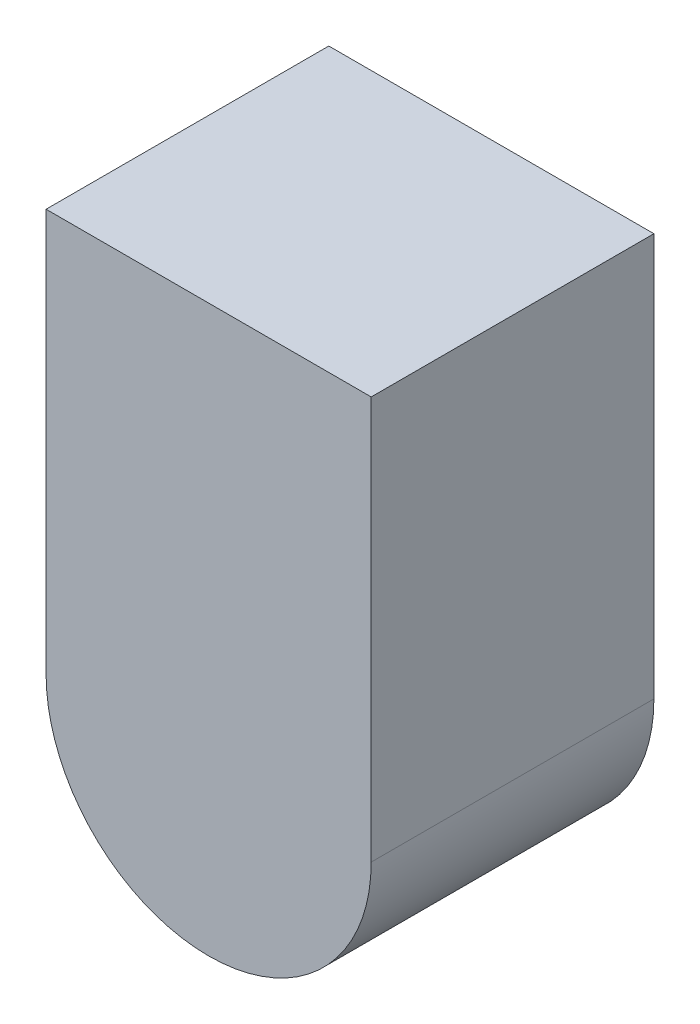
ISO-10303-21;
HEADER;
FILE_DESCRIPTION(('STEP AP214'),'2;1');
FILE_NAME('part.step','',(''),(''),'','','');
FILE_SCHEMA(('AUTOMOTIVE_DESIGN { 1 0 10303 214 1 1 1 1 }'));
ENDSEC;
DATA;
#1=APPLICATION_CONTEXT('core data for automotive mechanical design processes');
#2=APPLICATION_PROTOCOL_DEFINITION('international standard','automotive_design',2000,#1);
#3=PRODUCT_CONTEXT('',#1,'mechanical');
#4=PRODUCT('Part','Part','',(#3));
#5=PRODUCT_RELATED_PRODUCT_CATEGORY('part','',(#4));
#6=PRODUCT_DEFINITION_FORMATION('','',#4);
#7=PRODUCT_DEFINITION_CONTEXT('part definition',#1,'design');
#8=PRODUCT_DEFINITION('design','',#6,#7);
#9=PRODUCT_DEFINITION_SHAPE('','',#8);
#10=(LENGTH_UNIT() NAMED_UNIT(*) SI_UNIT(.MILLI.,.METRE.));
#11=(NAMED_UNIT(*) PLANE_ANGLE_UNIT() SI_UNIT($,.RADIAN.));
#12=(NAMED_UNIT(*) SI_UNIT($,.STERADIAN.) SOLID_ANGLE_UNIT());
#13=UNCERTAINTY_MEASURE_WITH_UNIT(LENGTH_MEASURE(1.E-05),#10,'distance_accuracy_value','');
#14=(GEOMETRIC_REPRESENTATION_CONTEXT(3) GLOBAL_UNCERTAINTY_ASSIGNED_CONTEXT((#13)) GLOBAL_UNIT_ASSIGNED_CONTEXT((#10,
#11,#12)) REPRESENTATION_CONTEXT('',''));
#15=CARTESIAN_POINT('',(0.,0.,0.));
#16=DIRECTION('',(0.,0.,1.));
#17=DIRECTION('',(1.,0.,0.));
#18=AXIS2_PLACEMENT_3D('',#15,#16,#17);
#19=CARTESIAN_POINT('',(-1.25,2.8335265642716,0.));
#20=DIRECTION('',(0.,0.,1.));
#21=DIRECTION('',(0.,-1.,0.));
#22=AXIS2_PLACEMENT_3D('',#19,#20,#21);
#23=PLANE('',#22);
#24=DIRECTION('',(-1.,0.,0.));
#25=VECTOR('',#24,1.);
#26=CARTESIAN_POINT('',(-1.135,3.,0.));
#27=LINE('',#26,#25);
#28=CARTESIAN_POINT('',(-1.135,3.,0.));
#29=VERTEX_POINT('',#28);
#30=CARTESIAN_POINT('',(-1.365,3.,0.));
#31=VERTEX_POINT('',#30);
#32=EDGE_CURVE('E11',#29,#31,#27,.T.);
#33=ORIENTED_EDGE('',*,*,#32,.F.);
#34=DIRECTION('',(0.,1.,0.));
#35=VECTOR('',#34,1.);
#36=CARTESIAN_POINT('',(-1.135,2.715,0.));
#37=LINE('',#36,#35);
#38=CARTESIAN_POINT('',(-1.135,2.715,0.));
#39=VERTEX_POINT('',#38);
#40=EDGE_CURVE('E24',#39,#29,#37,.T.);
#41=ORIENTED_EDGE('',*,*,#40,.F.);
#42=CARTESIAN_POINT('',(-1.25,2.715,0.));
#43=DIRECTION('',(0.,0.,1.));
#44=DIRECTION('',(-1.,0.,0.));
#45=AXIS2_PLACEMENT_3D('',#42,#43,#44);
#46=CIRCLE('',#45,0.115);
#47=CARTESIAN_POINT('',(-1.365,2.715,0.));
#48=VERTEX_POINT('',#47);
#49=EDGE_CURVE('E85',#48,#39,#46,.T.);
#50=ORIENTED_EDGE('',*,*,#49,.F.);
#51=DIRECTION('',(0.,-1.,0.));
#52=VECTOR('',#51,1.);
#53=CARTESIAN_POINT('',(-1.365,3.,0.));
#54=LINE('',#53,#52);
#55=EDGE_CURVE('E82',#31,#48,#54,.T.);
#56=ORIENTED_EDGE('',*,*,#55,.F.);
#57=EDGE_LOOP('',(#33,#41,#50,#56));
#58=FACE_BOUND('',#57,.T.);
#59=ADVANCED_FACE('F17',(#58),#23,.F.);
#60=CARTESIAN_POINT('',(-1.365,3.,0.));
#61=DIRECTION('',(-1.,0.,0.));
#62=DIRECTION('',(0.,-1.,0.));
#63=AXIS2_PLACEMENT_3D('',#60,#61,#62);
#64=PLANE('',#63);
#65=ORIENTED_EDGE('',*,*,#55,.T.);
#66=DIRECTION('',(0.,0.,1.));
#67=VECTOR('',#66,1.);
#68=CARTESIAN_POINT('',(-1.365,2.715,0.));
#69=LINE('',#68,#67);
#70=CARTESIAN_POINT('',(-1.365,2.715,0.2));
#71=VERTEX_POINT('',#70);
#72=EDGE_CURVE('E80',#48,#71,#69,.T.);
#73=ORIENTED_EDGE('',*,*,#72,.T.);
#74=DIRECTION('',(0.,-1.,0.));
#75=VECTOR('',#74,1.);
#76=CARTESIAN_POINT('',(-1.365,3.,0.2));
#77=LINE('',#76,#75);
#78=CARTESIAN_POINT('',(-1.365,3.,0.2));
#79=VERTEX_POINT('',#78);
#80=EDGE_CURVE('E78',#79,#71,#77,.T.);
#81=ORIENTED_EDGE('',*,*,#80,.F.);
#82=DIRECTION('',(0.,0.,-1.));
#83=VECTOR('',#82,1.);
#84=CARTESIAN_POINT('',(-1.365,3.,0.));
#85=LINE('',#84,#83);
#86=EDGE_CURVE('E71',#79,#31,#85,.T.);
#87=ORIENTED_EDGE('',*,*,#86,.T.);
#88=EDGE_LOOP('',(#65,#73,#81,#87));
#89=FACE_BOUND('',#88,.T.);
#90=ADVANCED_FACE('F91',(#89),#64,.T.);
#91=CARTESIAN_POINT('',(-1.25,2.715,0.));
#92=DIRECTION('',(0.,0.,1.));
#93=DIRECTION('',(-1.,0.,0.));
#94=AXIS2_PLACEMENT_3D('',#91,#92,#93);
#95=CYLINDRICAL_SURFACE('',#94,0.115);
#96=ORIENTED_EDGE('',*,*,#49,.T.);
#97=DIRECTION('',(0.,0.,1.));
#98=VECTOR('',#97,1.);
#99=CARTESIAN_POINT('',(-1.135,2.715,0.));
#100=LINE('',#99,#98);
#101=CARTESIAN_POINT('',(-1.135,2.715,0.2));
#102=VERTEX_POINT('',#101);
#103=EDGE_CURVE('E75',#39,#102,#100,.T.);
#104=ORIENTED_EDGE('',*,*,#103,.T.);
#105=CARTESIAN_POINT('',(-1.25,2.715,0.2));
#106=DIRECTION('',(0.,0.,1.));
#107=DIRECTION('',(-1.,0.,0.));
#108=AXIS2_PLACEMENT_3D('',#105,#106,#107);
#109=CIRCLE('',#108,0.115);
#110=EDGE_CURVE('E59',#71,#102,#109,.T.);
#111=ORIENTED_EDGE('',*,*,#110,.F.);
#112=ORIENTED_EDGE('',*,*,#72,.F.);
#113=EDGE_LOOP('',(#96,#104,#111,#112));
#114=FACE_BOUND('',#113,.T.);
#115=ADVANCED_FACE('F89',(#114),#95,.T.);
#116=CARTESIAN_POINT('',(-1.135,2.715,0.));
#117=DIRECTION('',(1.,0.,0.));
#118=DIRECTION('',(0.,1.,0.));
#119=AXIS2_PLACEMENT_3D('',#116,#117,#118);
#120=PLANE('',#119);
#121=ORIENTED_EDGE('',*,*,#40,.T.);
#122=DIRECTION('',(0.,0.,1.));
#123=VECTOR('',#122,1.);
#124=CARTESIAN_POINT('',(-1.135,3.,0.));
#125=LINE('',#124,#123);
#126=CARTESIAN_POINT('',(-1.135,3.,0.2));
#127=VERTEX_POINT('',#126);
#128=EDGE_CURVE('E53',#29,#127,#125,.T.);
#129=ORIENTED_EDGE('',*,*,#128,.T.);
#130=DIRECTION('',(0.,1.,0.));
#131=VECTOR('',#130,1.);
#132=CARTESIAN_POINT('',(-1.135,2.715,0.2));
#133=LINE('',#132,#131);
#134=EDGE_CURVE('E57',#102,#127,#133,.T.);
#135=ORIENTED_EDGE('',*,*,#134,.F.);
#136=ORIENTED_EDGE('',*,*,#103,.F.);
#137=EDGE_LOOP('',(#121,#129,#135,#136));
#138=FACE_BOUND('',#137,.T.);
#139=ADVANCED_FACE('F55',(#138),#120,.T.);
#140=CARTESIAN_POINT('',(3.,3.,0.));
#141=DIRECTION('',(0.,1.,0.));
#142=DIRECTION('',(-1.,0.,0.));
#143=AXIS2_PLACEMENT_3D('',#140,#141,#142);
#144=PLANE('',#143);
#145=ORIENTED_EDGE('',*,*,#86,.F.);
#146=DIRECTION('',(-1.,0.,0.));
#147=VECTOR('',#146,1.);
#148=CARTESIAN_POINT('',(0.875,3.,0.2));
#149=LINE('',#148,#147);
#150=EDGE_CURVE('E66',#127,#79,#149,.T.);
#151=ORIENTED_EDGE('',*,*,#150,.F.);
#152=ORIENTED_EDGE('',*,*,#128,.F.);
#153=ORIENTED_EDGE('',*,*,#32,.T.);
#154=EDGE_LOOP('',(#145,#151,#152,#153));
#155=FACE_BOUND('',#154,.T.);
#156=ADVANCED_FACE('F69',(#155),#144,.T.);
#157=CARTESIAN_POINT('',(-1.25,2.8335240809167,0.2));
#158=DIRECTION('',(0.,0.,1.));
#159=DIRECTION('',(1.,0.,0.));
#160=AXIS2_PLACEMENT_3D('',#157,#158,#159);
#161=PLANE('',#160);
#162=ORIENTED_EDGE('',*,*,#134,.T.);
#163=ORIENTED_EDGE('',*,*,#150,.T.);
#164=ORIENTED_EDGE('',*,*,#80,.T.);
#165=ORIENTED_EDGE('',*,*,#110,.T.);
#166=EDGE_LOOP('',(#162,#163,#164,#165));
#167=FACE_BOUND('',#166,.T.);
#168=ADVANCED_FACE('F64',(#167),#161,.T.);
#169=CLOSED_SHELL('',(#59,#90,#115,#139,#156,#168));
#170=MANIFOLD_SOLID_BREP('B1',#169);
#171=ADVANCED_BREP_SHAPE_REPRESENTATION('',(#18,#170),#14);
#172=SHAPE_DEFINITION_REPRESENTATION(#9,#171);
ENDSEC;
END-ISO-10303-21;
